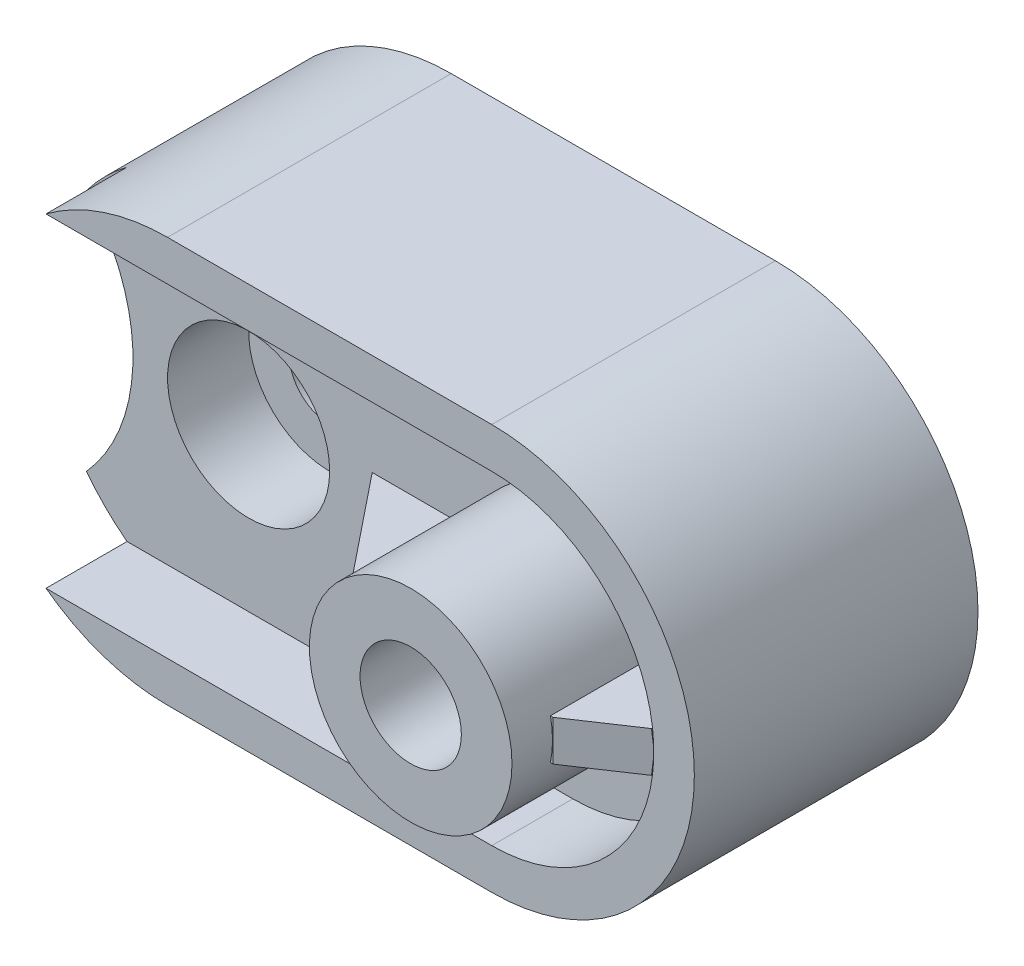
ISO-10303-21;
HEADER;
FILE_DESCRIPTION(('STEP AP214'),'2;1');
FILE_NAME('part.step','',(''),(''),'','','');
FILE_SCHEMA(('AUTOMOTIVE_DESIGN { 1 0 10303 214 1 1 1 1 }'));
ENDSEC;
DATA;
#1=APPLICATION_CONTEXT('core data for automotive mechanical design processes');
#2=APPLICATION_PROTOCOL_DEFINITION('international standard','automotive_design',2000,#1);
#3=PRODUCT_CONTEXT('',#1,'mechanical');
#4=PRODUCT('Part','Part','',(#3));
#5=PRODUCT_RELATED_PRODUCT_CATEGORY('part','',(#4));
#6=PRODUCT_DEFINITION_FORMATION('','',#4);
#7=PRODUCT_DEFINITION_CONTEXT('part definition',#1,'design');
#8=PRODUCT_DEFINITION('design','',#6,#7);
#9=PRODUCT_DEFINITION_SHAPE('','',#8);
#10=(LENGTH_UNIT() NAMED_UNIT(*) SI_UNIT(.MILLI.,.METRE.));
#11=(NAMED_UNIT(*) PLANE_ANGLE_UNIT() SI_UNIT($,.RADIAN.));
#12=(NAMED_UNIT(*) SI_UNIT($,.STERADIAN.) SOLID_ANGLE_UNIT());
#13=UNCERTAINTY_MEASURE_WITH_UNIT(LENGTH_MEASURE(1.E-05),#10,'distance_accuracy_value','');
#14=(GEOMETRIC_REPRESENTATION_CONTEXT(3) GLOBAL_UNCERTAINTY_ASSIGNED_CONTEXT((#13)) GLOBAL_UNIT_ASSIGNED_CONTEXT((#10,
#11,#12)) REPRESENTATION_CONTEXT('',''));
#15=CARTESIAN_POINT('',(0.,0.,0.));
#16=DIRECTION('',(0.,0.,1.));
#17=DIRECTION('',(1.,0.,0.));
#18=AXIS2_PLACEMENT_3D('',#15,#16,#17);
#19=CARTESIAN_POINT('',(0.,0.,50.));
#20=DIRECTION('',(0.,0.,1.));
#21=DIRECTION('',(1.,0.,0.));
#22=AXIS2_PLACEMENT_3D('',#19,#20,#21);
#23=PLANE('',#22);
#24=CARTESIAN_POINT('',(50.,50.,50.));
#25=DIRECTION('',(0.,0.,1.));
#26=DIRECTION('',(1.,0.,0.));
#27=AXIS2_PLACEMENT_3D('',#24,#25,#26);
#28=CIRCLE('',#27,20.);
#29=CARTESIAN_POINT('',(70.,50.,50.));
#30=VERTEX_POINT('',#29);
#31=EDGE_CURVE('E233',#30,#30,#28,.T.);
#32=ORIENTED_EDGE('',*,*,#31,.F.);
#33=EDGE_LOOP('',(#32));
#34=FACE_BOUND('',#33,.T.);
#35=CARTESIAN_POINT('',(130.,50.,50.));
#36=DIRECTION('',(0.,0.,1.));
#37=DIRECTION('',(1.,0.,0.));
#38=AXIS2_PLACEMENT_3D('',#35,#36,#37);
#39=CIRCLE('',#38,40.);
#40=CARTESIAN_POINT('',(169.686269665969,45.,50.));
#41=VERTEX_POINT('',#40);
#42=CARTESIAN_POINT('',(130.,9.99999999999999,50.));
#43=VERTEX_POINT('',#42);
#44=EDGE_CURVE('E253',#41,#43,#39,.F.);
#45=ORIENTED_EDGE('',*,*,#44,.F.);
#46=DIRECTION('',(1.,0.,0.));
#47=VECTOR('',#46,1.);
#48=CARTESIAN_POINT('',(0.,45.,50.));
#49=LINE('',#48,#47);
#50=CARTESIAN_POINT('',(154.494897427832,45.,50.));
#51=VERTEX_POINT('',#50);
#52=EDGE_CURVE('E199',#51,#41,#49,.T.);
#53=ORIENTED_EDGE('',*,*,#52,.F.);
#54=CARTESIAN_POINT('',(130.,50.,50.));
#55=DIRECTION('',(0.,0.,1.));
#56=DIRECTION('',(1.,0.,0.));
#57=AXIS2_PLACEMENT_3D('',#54,#55,#56);
#58=CIRCLE('',#57,25.);
#59=CARTESIAN_POINT('',(105.505102572168,45.,50.));
#60=VERTEX_POINT('',#59);
#61=EDGE_CURVE('E247',#60,#51,#58,.T.);
#62=ORIENTED_EDGE('',*,*,#61,.F.);
#63=DIRECTION('',(-1.,0.,0.));
#64=VECTOR('',#63,1.);
#65=CARTESIAN_POINT('',(0.,45.,50.));
#66=LINE('',#65,#64);
#67=CARTESIAN_POINT('',(80.5051025721682,45.,50.));
#68=VERTEX_POINT('',#67);
#69=EDGE_CURVE('E215',#60,#68,#66,.T.);
#70=ORIENTED_EDGE('',*,*,#69,.T.);
#71=DIRECTION('',(0.,-1.,0.));
#72=VECTOR('',#71,1.);
#73=CARTESIAN_POINT('',(80.5051025721682,0.,50.));
#74=LINE('',#73,#72);
#75=CARTESIAN_POINT('',(80.5051025721682,55.,50.));
#76=VERTEX_POINT('',#75);
#77=EDGE_CURVE('E221',#76,#68,#74,.T.);
#78=ORIENTED_EDGE('',*,*,#77,.F.);
#79=DIRECTION('',(-1.,0.,0.));
#80=VECTOR('',#79,1.);
#81=CARTESIAN_POINT('',(0.,55.,50.));
#82=LINE('',#81,#80);
#83=CARTESIAN_POINT('',(105.505102572168,55.,50.));
#84=VERTEX_POINT('',#83);
#85=EDGE_CURVE('E210',#84,#76,#82,.T.);
#86=ORIENTED_EDGE('',*,*,#85,.F.);
#87=CARTESIAN_POINT('',(154.494897427832,55.,50.));
#88=VERTEX_POINT('',#87);
#89=EDGE_CURVE('E242',#88,#84,#58,.T.);
#90=ORIENTED_EDGE('',*,*,#89,.F.);
#91=DIRECTION('',(1.,0.,0.));
#92=VECTOR('',#91,1.);
#93=CARTESIAN_POINT('',(0.,55.,50.));
#94=LINE('',#93,#92);
#95=CARTESIAN_POINT('',(169.686269665969,55.,50.));
#96=VERTEX_POINT('',#95);
#97=EDGE_CURVE('E195',#88,#96,#94,.T.);
#98=ORIENTED_EDGE('',*,*,#97,.T.);
#99=CARTESIAN_POINT('',(130.,90.,50.));
#100=VERTEX_POINT('',#99);
#101=EDGE_CURVE('E250',#100,#96,#39,.F.);
#102=ORIENTED_EDGE('',*,*,#101,.F.);
#103=DIRECTION('',(-1.,0.,0.));
#104=VECTOR('',#103,1.);
#105=CARTESIAN_POINT('',(0.,90.,50.));
#106=LINE('',#105,#104);
#107=CARTESIAN_POINT('',(20.,90.,50.));
#108=VERTEX_POINT('',#107);
#109=EDGE_CURVE('E252',#100,#108,#106,.T.);
#110=ORIENTED_EDGE('',*,*,#109,.T.);
#111=CARTESIAN_POINT('',(50.,50.,50.));
#112=DIRECTION('',(0.,0.,1.));
#113=DIRECTION('',(1.,0.,0.));
#114=AXIS2_PLACEMENT_3D('',#111,#112,#113);
#115=CIRCLE('',#114,50.);
#116=CARTESIAN_POINT('',(9.99999999999999,80.,50.));
#117=VERTEX_POINT('',#116);
#118=EDGE_CURVE('E256',#108,#117,#115,.T.);
#119=ORIENTED_EDGE('',*,*,#118,.T.);
#120=CARTESIAN_POINT('',(-23.5410196624968,50.,50.));
#121=DIRECTION('',(0.,0.,1.));
#122=DIRECTION('',(1.,0.,0.));
#123=AXIS2_PLACEMENT_3D('',#120,#121,#122);
#124=CIRCLE('',#123,45.);
#125=CARTESIAN_POINT('',(9.99999999999998,20.,50.));
#126=VERTEX_POINT('',#125);
#127=EDGE_CURVE('E258',#117,#126,#124,.F.);
#128=ORIENTED_EDGE('',*,*,#127,.T.);
#129=CARTESIAN_POINT('',(50.,50.,50.));
#130=DIRECTION('',(0.,0.,1.));
#131=DIRECTION('',(1.,0.,0.));
#132=AXIS2_PLACEMENT_3D('',#129,#130,#131);
#133=CIRCLE('',#132,50.);
#134=CARTESIAN_POINT('',(20.,9.99999999999999,50.));
#135=VERTEX_POINT('',#134);
#136=EDGE_CURVE('E260',#126,#135,#133,.T.);
#137=ORIENTED_EDGE('',*,*,#136,.T.);
#138=DIRECTION('',(-1.,0.,0.));
#139=VECTOR('',#138,1.);
#140=CARTESIAN_POINT('',(0.,9.99999999999999,50.));
#141=LINE('',#140,#139);
#142=EDGE_CURVE('E263',#43,#135,#141,.T.);
#143=ORIENTED_EDGE('',*,*,#142,.F.);
#144=EDGE_LOOP('',(#45,#53,#62,#70,#78,#86,#90,#98,#102,#110,#119,#128,#137,#143));
#145=FACE_BOUND('',#144,.T.);
#146=ADVANCED_FACE('F34',(#34,#145),#23,.T.);
#147=CARTESIAN_POINT('',(130.,50.,90.));
#148=DIRECTION('',(0.,0.,-1.));
#149=DIRECTION('',(-1.,0.,0.));
#150=AXIS2_PLACEMENT_3D('',#147,#148,#149);
#151=CYLINDRICAL_SURFACE('',#150,25.);
#152=CARTESIAN_POINT('',(130.,50.,90.));
#153=DIRECTION('',(0.,0.,1.));
#154=DIRECTION('',(1.,0.,0.));
#155=AXIS2_PLACEMENT_3D('',#152,#153,#154);
#156=CIRCLE('',#155,25.);
#157=CARTESIAN_POINT('',(155.,50.,90.));
#158=VERTEX_POINT('',#157);
#159=EDGE_CURVE('E243',#158,#158,#156,.T.);
#160=ORIENTED_EDGE('',*,*,#159,.F.);
#161=EDGE_LOOP('',(#160));
#162=FACE_BOUND('',#161,.T.);
#163=DIRECTION('',(0.,0.,-1.));
#164=VECTOR('',#163,1.);
#165=CARTESIAN_POINT('',(154.494897427832,45.,80.));
#166=LINE('',#165,#164);
#167=CARTESIAN_POINT('',(154.494897427832,45.,80.));
#168=VERTEX_POINT('',#167);
#169=EDGE_CURVE('E208',#168,#51,#166,.T.);
#170=ORIENTED_EDGE('',*,*,#169,.F.);
#171=CARTESIAN_POINT('',(130.,50.,80.));
#172=DIRECTION('',(0.,0.,1.));
#173=DIRECTION('',(1.,0.,0.));
#174=AXIS2_PLACEMENT_3D('',#171,#172,#173);
#175=CIRCLE('',#174,25.);
#176=CARTESIAN_POINT('',(154.494897427832,55.,80.));
#177=VERTEX_POINT('',#176);
#178=EDGE_CURVE('E57',#177,#168,#175,.F.);
#179=ORIENTED_EDGE('',*,*,#178,.F.);
#180=DIRECTION('',(0.,0.,-1.));
#181=VECTOR('',#180,1.);
#182=CARTESIAN_POINT('',(154.494897427832,55.,80.));
#183=LINE('',#182,#181);
#184=EDGE_CURVE('E193',#177,#88,#183,.T.);
#185=ORIENTED_EDGE('',*,*,#184,.T.);
#186=ORIENTED_EDGE('',*,*,#89,.T.);
#187=DIRECTION('',(0.,0.,-1.));
#188=VECTOR('',#187,1.);
#189=CARTESIAN_POINT('',(105.505102572168,55.,80.));
#190=LINE('',#189,#188);
#191=CARTESIAN_POINT('',(105.505102572168,55.,80.));
#192=VERTEX_POINT('',#191);
#193=EDGE_CURVE('E227',#192,#84,#190,.T.);
#194=ORIENTED_EDGE('',*,*,#193,.F.);
#195=CARTESIAN_POINT('',(130.,50.,80.));
#196=DIRECTION('',(0.,0.,1.));
#197=DIRECTION('',(1.,0.,0.));
#198=AXIS2_PLACEMENT_3D('',#195,#196,#197);
#199=CIRCLE('',#198,25.);
#200=CARTESIAN_POINT('',(105.505102572168,45.,80.));
#201=VERTEX_POINT('',#200);
#202=EDGE_CURVE('E335',#192,#201,#199,.T.);
#203=ORIENTED_EDGE('',*,*,#202,.T.);
#204=DIRECTION('',(0.,0.,-1.));
#205=VECTOR('',#204,1.);
#206=CARTESIAN_POINT('',(105.505102572168,45.,80.));
#207=LINE('',#206,#205);
#208=EDGE_CURVE('E218',#201,#60,#207,.T.);
#209=ORIENTED_EDGE('',*,*,#208,.T.);
#210=ORIENTED_EDGE('',*,*,#61,.T.);
#211=EDGE_LOOP('',(#170,#179,#185,#186,#194,#203,#209,#210));
#212=FACE_BOUND('',#211,.T.);
#213=ADVANCED_FACE('F400',(#162,#212),#151,.T.);
#214=CARTESIAN_POINT('',(130.,50.,50.));
#215=DIRECTION('',(0.,0.,1.));
#216=DIRECTION('',(1.,0.,0.));
#217=AXIS2_PLACEMENT_3D('',#214,#215,#216);
#218=CYLINDRICAL_SURFACE('',#217,40.);
#219=CARTESIAN_POINT('',(130.,50.,70.));
#220=DIRECTION('',(0.,0.,1.));
#221=DIRECTION('',(1.,0.,0.));
#222=AXIS2_PLACEMENT_3D('',#219,#220,#221);
#223=CIRCLE('',#222,40.);
#224=CARTESIAN_POINT('',(169.686269665969,45.,70.));
#225=VERTEX_POINT('',#224);
#226=CARTESIAN_POINT('',(130.,9.99999999999999,70.));
#227=VERTEX_POINT('',#226);
#228=EDGE_CURVE('E246',#225,#227,#223,.F.);
#229=ORIENTED_EDGE('',*,*,#228,.F.);
#230=DIRECTION('',(0.,0.,1.));
#231=VECTOR('',#230,1.);
#232=CARTESIAN_POINT('',(169.686269665969,45.,50.));
#233=LINE('',#232,#231);
#234=EDGE_CURVE('E11',#225,#41,#233,.F.);
#235=ORIENTED_EDGE('',*,*,#234,.T.);
#236=ORIENTED_EDGE('',*,*,#44,.T.);
#237=DIRECTION('',(0.,0.,1.));
#238=VECTOR('',#237,1.);
#239=CARTESIAN_POINT('',(130.,9.99999999999999,50.));
#240=LINE('',#239,#238);
#241=EDGE_CURVE('E278',#43,#227,#240,.T.);
#242=ORIENTED_EDGE('',*,*,#241,.T.);
#243=EDGE_LOOP('',(#229,#235,#236,#242));
#244=FACE_BOUND('',#243,.T.);
#245=ADVANCED_FACE('F367',(#244),#218,.F.);
#246=CARTESIAN_POINT('',(50.,50.,-36.));
#247=DIRECTION('',(0.,0.,1.));
#248=DIRECTION('',(1.,0.,0.));
#249=AXIS2_PLACEMENT_3D('',#246,#247,#248);
#250=CYLINDRICAL_SURFACE('',#249,10.);
#251=CARTESIAN_POINT('',(50.,50.,0.));
#252=DIRECTION('',(0.,0.,-1.));
#253=DIRECTION('',(-1.,0.,0.));
#254=AXIS2_PLACEMENT_3D('',#251,#252,#253);
#255=CIRCLE('',#254,10.);
#256=CARTESIAN_POINT('',(40.,50.,0.));
#257=VERTEX_POINT('',#256);
#258=EDGE_CURVE('E281',#257,#257,#255,.T.);
#259=ORIENTED_EDGE('',*,*,#258,.T.);
#260=EDGE_LOOP('',(#259));
#261=FACE_BOUND('',#260,.T.);
#262=CARTESIAN_POINT('',(50.,50.,30.));
#263=DIRECTION('',(0.,0.,1.));
#264=DIRECTION('',(1.,0.,0.));
#265=AXIS2_PLACEMENT_3D('',#262,#263,#264);
#266=CIRCLE('',#265,10.);
#267=CARTESIAN_POINT('',(60.,50.,30.));
#268=VERTEX_POINT('',#267);
#269=EDGE_CURVE('E230',#268,#268,#266,.T.);
#270=ORIENTED_EDGE('',*,*,#269,.T.);
#271=EDGE_LOOP('',(#270));
#272=FACE_BOUND('',#271,.T.);
#273=ADVANCED_FACE('F454',(#261,#272),#250,.F.);
#274=CARTESIAN_POINT('',(0.,0.,70.));
#275=DIRECTION('',(0.,0.,-1.));
#276=DIRECTION('',(-1.,0.,0.));
#277=AXIS2_PLACEMENT_3D('',#274,#275,#276);
#278=PLANE('',#277);
#279=DIRECTION('',(-1.,0.,0.));
#280=VECTOR('',#279,1.);
#281=CARTESIAN_POINT('',(0.,9.99999999999999,70.));
#282=LINE('',#281,#280);
#283=CARTESIAN_POINT('',(20.,9.99999999999999,70.));
#284=VERTEX_POINT('',#283);
#285=EDGE_CURVE('E275',#227,#284,#282,.T.);
#286=ORIENTED_EDGE('',*,*,#285,.T.);
#287=CARTESIAN_POINT('',(50.,50.,70.));
#288=DIRECTION('',(0.,0.,1.));
#289=DIRECTION('',(1.,0.,0.));
#290=AXIS2_PLACEMENT_3D('',#287,#288,#289);
#291=CIRCLE('',#290,50.);
#292=CARTESIAN_POINT('',(50.,0.,70.));
#293=VERTEX_POINT('',#292);
#294=EDGE_CURVE('E319',#284,#293,#291,.T.);
#295=ORIENTED_EDGE('',*,*,#294,.T.);
#296=DIRECTION('',(1.,0.,0.));
#297=VECTOR('',#296,1.);
#298=CARTESIAN_POINT('',(0.,0.,70.));
#299=LINE('',#298,#297);
#300=CARTESIAN_POINT('',(130.,0.,70.));
#301=VERTEX_POINT('',#300);
#302=EDGE_CURVE('E329',#293,#301,#299,.T.);
#303=ORIENTED_EDGE('',*,*,#302,.T.);
#304=CARTESIAN_POINT('',(130.,50.,70.));
#305=DIRECTION('',(0.,0.,1.));
#306=DIRECTION('',(1.,0.,0.));
#307=AXIS2_PLACEMENT_3D('',#304,#305,#306);
#308=CIRCLE('',#307,50.);
#309=CARTESIAN_POINT('',(130.,100.,70.));
#310=VERTEX_POINT('',#309);
#311=EDGE_CURVE('E308',#310,#301,#308,.F.);
#312=ORIENTED_EDGE('',*,*,#311,.F.);
#313=DIRECTION('',(-1.,0.,0.));
#314=VECTOR('',#313,1.);
#315=CARTESIAN_POINT('',(0.,100.,70.));
#316=LINE('',#315,#314);
#317=CARTESIAN_POINT('',(50.,100.,70.));
#318=VERTEX_POINT('',#317);
#319=EDGE_CURVE('E332',#310,#318,#316,.T.);
#320=ORIENTED_EDGE('',*,*,#319,.T.);
#321=CARTESIAN_POINT('',(20.,90.,70.));
#322=VERTEX_POINT('',#321);
#323=EDGE_CURVE('E323',#318,#322,#291,.T.);
#324=ORIENTED_EDGE('',*,*,#323,.T.);
#325=DIRECTION('',(-1.,0.,0.));
#326=VECTOR('',#325,1.);
#327=CARTESIAN_POINT('',(0.,90.,70.));
#328=LINE('',#327,#326);
#329=CARTESIAN_POINT('',(130.,90.,70.));
#330=VERTEX_POINT('',#329);
#331=EDGE_CURVE('E272',#330,#322,#328,.T.);
#332=ORIENTED_EDGE('',*,*,#331,.F.);
#333=CARTESIAN_POINT('',(169.686269665969,55.,70.));
#334=VERTEX_POINT('',#333);
#335=EDGE_CURVE('E269',#330,#334,#223,.F.);
#336=ORIENTED_EDGE('',*,*,#335,.T.);
#337=EDGE_CURVE('E273',#334,#225,#223,.F.);
#338=ORIENTED_EDGE('',*,*,#337,.T.);
#339=ORIENTED_EDGE('',*,*,#228,.T.);
#340=EDGE_LOOP('',(#286,#295,#303,#312,#320,#324,#332,#336,#338,#339));
#341=FACE_BOUND('',#340,.T.);
#342=ADVANCED_FACE('F356',(#341),#278,.F.);
#343=CARTESIAN_POINT('',(50.,50.,0.));
#344=DIRECTION('',(0.,0.,1.));
#345=DIRECTION('',(1.,0.,0.));
#346=AXIS2_PLACEMENT_3D('',#343,#344,#345);
#347=CYLINDRICAL_SURFACE('',#346,50.);
#348=ORIENTED_EDGE('',*,*,#294,.F.);
#349=DIRECTION('',(0.,0.,1.));
#350=VECTOR('',#349,1.);
#351=CARTESIAN_POINT('',(20.,9.99999999999999,50.));
#352=LINE('',#351,#350);
#353=EDGE_CURVE('E282',#135,#284,#352,.T.);
#354=ORIENTED_EDGE('',*,*,#353,.F.);
#355=ORIENTED_EDGE('',*,*,#136,.F.);
#356=DIRECTION('',(0.,0.,1.));
#357=VECTOR('',#356,1.);
#358=CARTESIAN_POINT('',(9.99999999999998,20.,20.));
#359=LINE('',#358,#357);
#360=CARTESIAN_POINT('',(9.99999999999998,20.,20.));
#361=VERTEX_POINT('',#360);
#362=EDGE_CURVE('E297',#361,#126,#359,.T.);
#363=ORIENTED_EDGE('',*,*,#362,.F.);
#364=CARTESIAN_POINT('',(50.,50.,20.));
#365=DIRECTION('',(0.,0.,1.));
#366=DIRECTION('',(1.,0.,0.));
#367=AXIS2_PLACEMENT_3D('',#364,#365,#366);
#368=CIRCLE('',#367,50.);
#369=CARTESIAN_POINT('',(9.99999999999999,80.,20.));
#370=VERTEX_POINT('',#369);
#371=EDGE_CURVE('E290',#370,#361,#368,.T.);
#372=ORIENTED_EDGE('',*,*,#371,.F.);
#373=DIRECTION('',(0.,0.,1.));
#374=VECTOR('',#373,1.);
#375=CARTESIAN_POINT('',(9.99999999999999,80.,20.));
#376=LINE('',#375,#374);
#377=EDGE_CURVE('E296',#370,#117,#376,.T.);
#378=ORIENTED_EDGE('',*,*,#377,.T.);
#379=ORIENTED_EDGE('',*,*,#118,.F.);
#380=DIRECTION('',(0.,0.,1.));
#381=VECTOR('',#380,1.);
#382=CARTESIAN_POINT('',(20.,90.,50.));
#383=LINE('',#382,#381);
#384=EDGE_CURVE('E284',#108,#322,#383,.T.);
#385=ORIENTED_EDGE('',*,*,#384,.T.);
#386=ORIENTED_EDGE('',*,*,#323,.F.);
#387=DIRECTION('',(0.,0.,1.));
#388=VECTOR('',#387,1.);
#389=CARTESIAN_POINT('',(50.,100.,0.));
#390=LINE('',#389,#388);
#391=CARTESIAN_POINT('',(50.,100.,0.));
#392=VERTEX_POINT('',#391);
#393=EDGE_CURVE('E322',#392,#318,#390,.T.);
#394=ORIENTED_EDGE('',*,*,#393,.F.);
#395=CARTESIAN_POINT('',(50.,50.,0.));
#396=DIRECTION('',(0.,0.,1.));
#397=DIRECTION('',(1.,0.,0.));
#398=AXIS2_PLACEMENT_3D('',#395,#396,#397);
#399=CIRCLE('',#398,50.);
#400=CARTESIAN_POINT('',(50.,0.,0.));
#401=VERTEX_POINT('',#400);
#402=EDGE_CURVE('E320',#392,#401,#399,.T.);
#403=ORIENTED_EDGE('',*,*,#402,.T.);
#404=DIRECTION('',(0.,0.,1.));
#405=VECTOR('',#404,1.);
#406=CARTESIAN_POINT('',(50.,0.,0.));
#407=LINE('',#406,#405);
#408=EDGE_CURVE('E316',#401,#293,#407,.T.);
#409=ORIENTED_EDGE('',*,*,#408,.T.);
#410=EDGE_LOOP('',(#348,#354,#355,#363,#372,#378,#379,#385,#386,#394,#403,#409));
#411=FACE_BOUND('',#410,.T.);
#412=ADVANCED_FACE('F375',(#411),#347,.T.);
#413=CARTESIAN_POINT('',(-23.5410196624968,50.,20.));
#414=DIRECTION('',(0.,0.,1.));
#415=DIRECTION('',(1.,0.,0.));
#416=AXIS2_PLACEMENT_3D('',#413,#414,#415);
#417=CYLINDRICAL_SURFACE('',#416,45.);
#418=ORIENTED_EDGE('',*,*,#362,.T.);
#419=ORIENTED_EDGE('',*,*,#127,.F.);
#420=ORIENTED_EDGE('',*,*,#377,.F.);
#421=CARTESIAN_POINT('',(-23.5410196624968,50.,20.));
#422=DIRECTION('',(0.,0.,1.));
#423=DIRECTION('',(1.,0.,0.));
#424=AXIS2_PLACEMENT_3D('',#421,#422,#423);
#425=CIRCLE('',#424,45.);
#426=EDGE_CURVE('E288',#370,#361,#425,.F.);
#427=ORIENTED_EDGE('',*,*,#426,.T.);
#428=EDGE_LOOP('',(#418,#419,#420,#427));
#429=FACE_BOUND('',#428,.T.);
#430=ADVANCED_FACE('F461',(#429),#417,.F.);
#431=CARTESIAN_POINT('',(9.99999999999997,50.,0.));
#432=DIRECTION('',(0.,0.,1.));
#433=DIRECTION('',(1.,0.,0.));
#434=AXIS2_PLACEMENT_3D('',#431,#432,#433);
#435=CYLINDRICAL_SURFACE('',#434,5.);
#436=CARTESIAN_POINT('',(9.99999999999997,50.,0.));
#437=DIRECTION('',(0.,0.,1.));
#438=DIRECTION('',(1.,0.,0.));
#439=AXIS2_PLACEMENT_3D('',#436,#437,#438);
#440=CIRCLE('',#439,5.);
#441=CARTESIAN_POINT('',(15.,50.,0.));
#442=VERTEX_POINT('',#441);
#443=EDGE_CURVE('E300',#442,#442,#440,.T.);
#444=ORIENTED_EDGE('',*,*,#443,.F.);
#445=EDGE_LOOP('',(#444));
#446=FACE_BOUND('',#445,.T.);
#447=CARTESIAN_POINT('',(9.99999999999997,50.,20.));
#448=DIRECTION('',(0.,0.,1.));
#449=DIRECTION('',(1.,0.,0.));
#450=AXIS2_PLACEMENT_3D('',#447,#448,#449);
#451=CIRCLE('',#450,5.);
#452=CARTESIAN_POINT('',(15.,50.,20.));
#453=VERTEX_POINT('',#452);
#454=EDGE_CURVE('E293',#453,#453,#451,.F.);
#455=ORIENTED_EDGE('',*,*,#454,.F.);
#456=EDGE_LOOP('',(#455));
#457=FACE_BOUND('',#456,.T.);
#458=ADVANCED_FACE('F464',(#446,#457),#435,.F.);
#459=CARTESIAN_POINT('',(0.,0.,70.));
#460=DIRECTION('',(0.,1.,0.));
#461=DIRECTION('',(0.,0.,1.));
#462=AXIS2_PLACEMENT_3D('',#459,#460,#461);
#463=PLANE('',#462);
#464=DIRECTION('',(0.,0.,1.));
#465=VECTOR('',#464,1.);
#466=CARTESIAN_POINT('',(130.,0.,0.));
#467=LINE('',#466,#465);
#468=CARTESIAN_POINT('',(130.,0.,0.));
#469=VERTEX_POINT('',#468);
#470=EDGE_CURVE('E312',#469,#301,#467,.T.);
#471=ORIENTED_EDGE('',*,*,#470,.T.);
#472=ORIENTED_EDGE('',*,*,#302,.F.);
#473=ORIENTED_EDGE('',*,*,#408,.F.);
#474=DIRECTION('',(1.,0.,0.));
#475=VECTOR('',#474,1.);
#476=CARTESIAN_POINT('',(0.,0.,0.));
#477=LINE('',#476,#475);
#478=EDGE_CURVE('E328',#401,#469,#477,.T.);
#479=ORIENTED_EDGE('',*,*,#478,.T.);
#480=EDGE_LOOP('',(#471,#472,#473,#479));
#481=FACE_BOUND('',#480,.T.);
#482=ADVANCED_FACE('F36',(#481),#463,.F.);
#483=CARTESIAN_POINT('',(0.,0.,0.));
#484=DIRECTION('',(0.,0.,-1.));
#485=DIRECTION('',(-1.,0.,0.));
#486=AXIS2_PLACEMENT_3D('',#483,#484,#485);
#487=PLANE('',#486);
#488=ORIENTED_EDGE('',*,*,#258,.F.);
#489=EDGE_LOOP('',(#488));
#490=FACE_BOUND('',#489,.T.);
#491=ORIENTED_EDGE('',*,*,#443,.T.);
#492=EDGE_LOOP('',(#491));
#493=FACE_BOUND('',#492,.T.);
#494=DIRECTION('',(-1.,0.,0.));
#495=VECTOR('',#494,1.);
#496=CARTESIAN_POINT('',(0.,100.,0.));
#497=LINE('',#496,#495);
#498=CARTESIAN_POINT('',(130.,100.,0.));
#499=VERTEX_POINT('',#498);
#500=EDGE_CURVE('E333',#499,#392,#497,.T.);
#501=ORIENTED_EDGE('',*,*,#500,.F.);
#502=CARTESIAN_POINT('',(130.,50.,0.));
#503=DIRECTION('',(0.,0.,1.));
#504=DIRECTION('',(1.,0.,0.));
#505=AXIS2_PLACEMENT_3D('',#502,#503,#504);
#506=CIRCLE('',#505,50.);
#507=EDGE_CURVE('E309',#499,#469,#506,.F.);
#508=ORIENTED_EDGE('',*,*,#507,.T.);
#509=ORIENTED_EDGE('',*,*,#478,.F.);
#510=ORIENTED_EDGE('',*,*,#402,.F.);
#511=EDGE_LOOP('',(#501,#508,#509,#510));
#512=FACE_BOUND('',#511,.T.);
#513=ADVANCED_FACE('F385',(#490,#493,#512),#487,.T.);
#514=CARTESIAN_POINT('',(0.,100.,70.));
#515=DIRECTION('',(0.,-1.,0.));
#516=DIRECTION('',(0.,0.,-1.));
#517=AXIS2_PLACEMENT_3D('',#514,#515,#516);
#518=PLANE('',#517);
#519=ORIENTED_EDGE('',*,*,#319,.F.);
#520=DIRECTION('',(0.,0.,1.));
#521=VECTOR('',#520,1.);
#522=CARTESIAN_POINT('',(130.,100.,0.));
#523=LINE('',#522,#521);
#524=EDGE_CURVE('E305',#499,#310,#523,.T.);
#525=ORIENTED_EDGE('',*,*,#524,.F.);
#526=ORIENTED_EDGE('',*,*,#500,.T.);
#527=ORIENTED_EDGE('',*,*,#393,.T.);
#528=EDGE_LOOP('',(#519,#525,#526,#527));
#529=FACE_BOUND('',#528,.T.);
#530=ADVANCED_FACE('F390',(#529),#518,.F.);
#531=CARTESIAN_POINT('',(130.,50.,0.));
#532=DIRECTION('',(0.,0.,1.));
#533=DIRECTION('',(1.,0.,0.));
#534=AXIS2_PLACEMENT_3D('',#531,#532,#533);
#535=CYLINDRICAL_SURFACE('',#534,50.);
#536=ORIENTED_EDGE('',*,*,#311,.T.);
#537=ORIENTED_EDGE('',*,*,#470,.F.);
#538=ORIENTED_EDGE('',*,*,#507,.F.);
#539=ORIENTED_EDGE('',*,*,#524,.T.);
#540=EDGE_LOOP('',(#536,#537,#538,#539));
#541=FACE_BOUND('',#540,.T.);
#542=ADVANCED_FACE('F381',(#541),#535,.T.);
#543=CARTESIAN_POINT('',(0.,0.,20.));
#544=DIRECTION('',(0.,0.,1.));
#545=DIRECTION('',(1.,0.,0.));
#546=AXIS2_PLACEMENT_3D('',#543,#544,#545);
#547=PLANE('',#546);
#548=ORIENTED_EDGE('',*,*,#426,.F.);
#549=ORIENTED_EDGE('',*,*,#371,.T.);
#550=EDGE_LOOP('',(#548,#549));
#551=FACE_BOUND('',#550,.T.);
#552=ORIENTED_EDGE('',*,*,#454,.T.);
#553=EDGE_LOOP('',(#552));
#554=FACE_BOUND('',#553,.T.);
#555=ADVANCED_FACE('F447',(#551,#554),#547,.T.);
#556=DIRECTION('',(0.,0.,1.));
#557=VECTOR('',#556,1.);
#558=CARTESIAN_POINT('',(169.686269665969,55.,50.));
#559=LINE('',#558,#557);
#560=EDGE_CURVE('E42',#334,#96,#559,.F.);
#561=ORIENTED_EDGE('',*,*,#560,.F.);
#562=ORIENTED_EDGE('',*,*,#335,.F.);
#563=DIRECTION('',(0.,0.,1.));
#564=VECTOR('',#563,1.);
#565=CARTESIAN_POINT('',(130.,90.,50.));
#566=LINE('',#565,#564);
#567=EDGE_CURVE('E268',#100,#330,#566,.T.);
#568=ORIENTED_EDGE('',*,*,#567,.F.);
#569=ORIENTED_EDGE('',*,*,#101,.T.);
#570=EDGE_LOOP('',(#561,#562,#568,#569));
#571=FACE_BOUND('',#570,.T.);
#572=ADVANCED_FACE('F350',(#571),#218,.F.);
#573=CARTESIAN_POINT('',(0.,9.99999999999999,50.));
#574=DIRECTION('',(0.,1.,0.));
#575=DIRECTION('',(0.,0.,1.));
#576=AXIS2_PLACEMENT_3D('',#573,#574,#575);
#577=PLANE('',#576);
#578=ORIENTED_EDGE('',*,*,#285,.F.);
#579=ORIENTED_EDGE('',*,*,#241,.F.);
#580=ORIENTED_EDGE('',*,*,#142,.T.);
#581=ORIENTED_EDGE('',*,*,#353,.T.);
#582=EDGE_LOOP('',(#578,#579,#580,#581));
#583=FACE_BOUND('',#582,.T.);
#584=ADVANCED_FACE('F365',(#583),#577,.T.);
#585=CARTESIAN_POINT('',(0.,90.,50.));
#586=DIRECTION('',(0.,1.,0.));
#587=DIRECTION('',(0.,0.,1.));
#588=AXIS2_PLACEMENT_3D('',#585,#586,#587);
#589=PLANE('',#588);
#590=ORIENTED_EDGE('',*,*,#331,.T.);
#591=ORIENTED_EDGE('',*,*,#384,.F.);
#592=ORIENTED_EDGE('',*,*,#109,.F.);
#593=ORIENTED_EDGE('',*,*,#567,.T.);
#594=EDGE_LOOP('',(#590,#591,#592,#593));
#595=FACE_BOUND('',#594,.T.);
#596=ADVANCED_FACE('F395',(#595),#589,.F.);
#597=CARTESIAN_POINT('',(130.,50.,90.));
#598=DIRECTION('',(0.,0.,1.));
#599=DIRECTION('',(1.,0.,0.));
#600=AXIS2_PLACEMENT_3D('',#597,#598,#599);
#601=PLANE('',#600);
#602=ORIENTED_EDGE('',*,*,#159,.T.);
#603=EDGE_LOOP('',(#602));
#604=FACE_BOUND('',#603,.T.);
#605=CARTESIAN_POINT('',(130.,50.,90.));
#606=DIRECTION('',(0.,0.,1.));
#607=DIRECTION('',(1.,0.,0.));
#608=AXIS2_PLACEMENT_3D('',#605,#606,#607);
#609=CIRCLE('',#608,12.5);
#610=CARTESIAN_POINT('',(142.5,50.,90.));
#611=VERTEX_POINT('',#610);
#612=EDGE_CURVE('E237',#611,#611,#609,.T.);
#613=ORIENTED_EDGE('',*,*,#612,.F.);
#614=EDGE_LOOP('',(#613));
#615=FACE_BOUND('',#614,.T.);
#616=ADVANCED_FACE('F444',(#604,#615),#601,.T.);
#617=CARTESIAN_POINT('',(130.,50.,90.));
#618=DIRECTION('',(0.,0.,-1.));
#619=DIRECTION('',(-1.,0.,0.));
#620=AXIS2_PLACEMENT_3D('',#617,#618,#619);
#621=CYLINDRICAL_SURFACE('',#620,12.5);
#622=ORIENTED_EDGE('',*,*,#612,.T.);
#623=EDGE_LOOP('',(#622));
#624=FACE_BOUND('',#623,.T.);
#625=CARTESIAN_POINT('',(130.,50.,50.));
#626=DIRECTION('',(0.,0.,1.));
#627=DIRECTION('',(1.,0.,0.));
#628=AXIS2_PLACEMENT_3D('',#625,#626,#627);
#629=CIRCLE('',#628,12.5);
#630=CARTESIAN_POINT('',(142.5,50.,50.));
#631=VERTEX_POINT('',#630);
#632=EDGE_CURVE('E265',#631,#631,#629,.F.);
#633=ORIENTED_EDGE('',*,*,#632,.T.);
#634=EDGE_LOOP('',(#633));
#635=FACE_BOUND('',#634,.T.);
#636=ADVANCED_FACE('F452',(#624,#635),#621,.F.);
#637=CARTESIAN_POINT('',(130.,50.,50.));
#638=DIRECTION('',(0.,0.,1.));
#639=DIRECTION('',(1.,0.,0.));
#640=AXIS2_PLACEMENT_3D('',#637,#638,#639);
#641=CONICAL_SURFACE('',#640,12.5,1.02974425867665);
#642=CARTESIAN_POINT('',(130.,50.,42.4892422621555));
#643=VERTEX_POINT('',#642);
#644=VERTEX_LOOP('',#643);
#645=FACE_BOUND('',#644,.T.);
#646=ORIENTED_EDGE('',*,*,#632,.F.);
#647=EDGE_LOOP('',(#646));
#648=FACE_BOUND('',#647,.T.);
#649=ADVANCED_FACE('F448',(#645,#648),#641,.F.);
#650=CARTESIAN_POINT('',(50.,50.,30.));
#651=DIRECTION('',(0.,0.,1.));
#652=DIRECTION('',(1.,0.,0.));
#653=AXIS2_PLACEMENT_3D('',#650,#651,#652);
#654=CYLINDRICAL_SURFACE('',#653,20.);
#655=CARTESIAN_POINT('',(50.,50.,30.));
#656=DIRECTION('',(0.,0.,1.));
#657=DIRECTION('',(1.,0.,0.));
#658=AXIS2_PLACEMENT_3D('',#655,#656,#657);
#659=CIRCLE('',#658,20.);
#660=CARTESIAN_POINT('',(70.,50.,30.));
#661=VERTEX_POINT('',#660);
#662=EDGE_CURVE('E234',#661,#661,#659,.T.);
#663=ORIENTED_EDGE('',*,*,#662,.F.);
#664=EDGE_LOOP('',(#663));
#665=FACE_BOUND('',#664,.T.);
#666=ORIENTED_EDGE('',*,*,#31,.T.);
#667=EDGE_LOOP('',(#666));
#668=FACE_BOUND('',#667,.T.);
#669=ADVANCED_FACE('F451',(#665,#668),#654,.F.);
#670=CARTESIAN_POINT('',(50.,50.,30.));
#671=DIRECTION('',(0.,0.,1.));
#672=DIRECTION('',(1.,0.,0.));
#673=AXIS2_PLACEMENT_3D('',#670,#671,#672);
#674=PLANE('',#673);
#675=ORIENTED_EDGE('',*,*,#269,.F.);
#676=EDGE_LOOP('',(#675));
#677=FACE_BOUND('',#676,.T.);
#678=ORIENTED_EDGE('',*,*,#662,.T.);
#679=EDGE_LOOP('',(#678));
#680=FACE_BOUND('',#679,.T.);
#681=ADVANCED_FACE('F532',(#677,#680),#674,.T.);
#682=CARTESIAN_POINT('',(0.,0.,80.));
#683=DIRECTION('',(0.,0.,1.));
#684=DIRECTION('',(1.,0.,0.));
#685=AXIS2_PLACEMENT_3D('',#682,#683,#684);
#686=PLANE('',#685);
#687=DIRECTION('',(0.,1.,0.));
#688=VECTOR('',#687,1.);
#689=CARTESIAN_POINT('',(104.57894091063,45.,80.));
#690=LINE('',#689,#688);
#691=CARTESIAN_POINT('',(104.57894091063,45.,80.));
#692=VERTEX_POINT('',#691);
#693=CARTESIAN_POINT('',(104.57894091063,55.,80.));
#694=VERTEX_POINT('',#693);
#695=EDGE_CURVE('E409',#692,#694,#690,.T.);
#696=ORIENTED_EDGE('',*,*,#695,.F.);
#697=DIRECTION('',(-1.,0.,0.));
#698=VECTOR('',#697,1.);
#699=CARTESIAN_POINT('',(0.,45.,80.));
#700=LINE('',#699,#698);
#701=EDGE_CURVE('E214',#201,#692,#700,.T.);
#702=ORIENTED_EDGE('',*,*,#701,.F.);
#703=ORIENTED_EDGE('',*,*,#202,.F.);
#704=DIRECTION('',(-1.,0.,0.));
#705=VECTOR('',#704,1.);
#706=CARTESIAN_POINT('',(0.,55.,80.));
#707=LINE('',#706,#705);
#708=EDGE_CURVE('E211',#192,#694,#707,.T.);
#709=ORIENTED_EDGE('',*,*,#708,.T.);
#710=EDGE_LOOP('',(#696,#702,#703,#709));
#711=FACE_BOUND('',#710,.T.);
#712=ADVANCED_FACE('F408',(#711),#686,.T.);
#713=CARTESIAN_POINT('',(0.,55.,80.));
#714=DIRECTION('',(0.,-1.,0.));
#715=DIRECTION('',(1.,0.,0.));
#716=AXIS2_PLACEMENT_3D('',#713,#714,#715);
#717=PLANE('',#716);
#718=ORIENTED_EDGE('',*,*,#85,.T.);
#719=DIRECTION('',(-0.625864850773297,0.,-0.779931528127001));
#720=VECTOR('',#719,1.);
#721=CARTESIAN_POINT('',(104.57894091063,55.,80.));
#722=LINE('',#721,#720);
#723=EDGE_CURVE('E405',#694,#76,#722,.T.);
#724=ORIENTED_EDGE('',*,*,#723,.F.);
#725=ORIENTED_EDGE('',*,*,#708,.F.);
#726=ORIENTED_EDGE('',*,*,#193,.T.);
#727=EDGE_LOOP('',(#718,#724,#725,#726));
#728=FACE_BOUND('',#727,.T.);
#729=ADVANCED_FACE('F403',(#728),#717,.F.);
#730=CARTESIAN_POINT('',(0.,45.,80.));
#731=DIRECTION('',(0.,-1.,0.));
#732=DIRECTION('',(1.,0.,0.));
#733=AXIS2_PLACEMENT_3D('',#730,#731,#732);
#734=PLANE('',#733);
#735=DIRECTION('',(-0.625864850773297,0.,-0.779931528127001));
#736=VECTOR('',#735,1.);
#737=CARTESIAN_POINT('',(104.57894091063,45.,80.));
#738=LINE('',#737,#736);
#739=EDGE_CURVE('E415',#692,#68,#738,.T.);
#740=ORIENTED_EDGE('',*,*,#739,.T.);
#741=ORIENTED_EDGE('',*,*,#69,.F.);
#742=ORIENTED_EDGE('',*,*,#208,.F.);
#743=ORIENTED_EDGE('',*,*,#701,.T.);
#744=EDGE_LOOP('',(#740,#741,#742,#743));
#745=FACE_BOUND('',#744,.T.);
#746=ADVANCED_FACE('F414',(#745),#734,.T.);
#747=CARTESIAN_POINT('',(130.,50.,80.));
#748=DIRECTION('',(0.,0.,-1.));
#749=DIRECTION('',(-1.,0.,0.));
#750=AXIS2_PLACEMENT_3D('',#747,#748,#749);
#751=CYLINDRICAL_SURFACE('',#750,40.);
#752=DIRECTION('',(0.,0.,-1.));
#753=VECTOR('',#752,1.);
#754=CARTESIAN_POINT('',(169.686269665969,55.,80.));
#755=LINE('',#754,#753);
#756=CARTESIAN_POINT('',(169.686269665969,55.,70.2759725439482));
#757=VERTEX_POINT('',#756);
#758=EDGE_CURVE('E205',#757,#334,#755,.T.);
#759=ORIENTED_EDGE('',*,*,#758,.F.);
#760=CARTESIAN_POINT('',(130.,50.,96.8368636461383));
#761=DIRECTION('',(-0.556197994044663,0.,-0.831049812839575));
#762=DIRECTION('',(0.831049812839575,0.,-0.556197994044664));
#763=AXIS2_PLACEMENT_3D('',#760,#761,#762);
#764=ELLIPSE('',#763,48.1318921946759,40.);
#765=CARTESIAN_POINT('',(169.686269665969,45.,70.2759725439482));
#766=VERTEX_POINT('',#765);
#767=EDGE_CURVE('E179',#757,#766,#764,.T.);
#768=ORIENTED_EDGE('',*,*,#767,.T.);
#769=DIRECTION('',(0.,0.,-1.));
#770=VECTOR('',#769,1.);
#771=CARTESIAN_POINT('',(169.686269665969,45.,80.));
#772=LINE('',#771,#770);
#773=EDGE_CURVE('E188',#766,#225,#772,.T.);
#774=ORIENTED_EDGE('',*,*,#773,.T.);
#775=ORIENTED_EDGE('',*,*,#337,.F.);
#776=EDGE_LOOP('',(#759,#768,#774,#775));
#777=FACE_BOUND('',#776,.T.);
#778=ADVANCED_FACE('F358',(#777),#751,.T.);
#779=CARTESIAN_POINT('',(0.,45.,80.));
#780=DIRECTION('',(0.,1.,0.));
#781=DIRECTION('',(0.,0.,1.));
#782=AXIS2_PLACEMENT_3D('',#779,#780,#781);
#783=PLANE('',#782);
#784=ORIENTED_EDGE('',*,*,#773,.F.);
#785=DIRECTION('',(-0.831049812839575,0.,0.556197994044663));
#786=VECTOR('',#785,1.);
#787=CARTESIAN_POINT('',(155.156999003497,45.,80.));
#788=LINE('',#787,#786);
#789=CARTESIAN_POINT('',(155.156999003497,45.,80.));
#790=VERTEX_POINT('',#789);
#791=EDGE_CURVE('E173',#766,#790,#788,.T.);
#792=ORIENTED_EDGE('',*,*,#791,.T.);
#793=DIRECTION('',(1.,0.,0.));
#794=VECTOR('',#793,1.);
#795=CARTESIAN_POINT('',(0.,45.,80.));
#796=LINE('',#795,#794);
#797=EDGE_CURVE('E186',#168,#790,#796,.T.);
#798=ORIENTED_EDGE('',*,*,#797,.F.);
#799=ORIENTED_EDGE('',*,*,#169,.T.);
#800=ORIENTED_EDGE('',*,*,#52,.T.);
#801=ORIENTED_EDGE('',*,*,#234,.F.);
#802=EDGE_LOOP('',(#784,#792,#798,#799,#800,#801));
#803=FACE_BOUND('',#802,.T.);
#804=ADVANCED_FACE('F184',(#803),#783,.F.);
#805=CARTESIAN_POINT('',(0.,55.,80.));
#806=DIRECTION('',(0.,1.,0.));
#807=DIRECTION('',(0.,0.,1.));
#808=AXIS2_PLACEMENT_3D('',#805,#806,#807);
#809=PLANE('',#808);
#810=DIRECTION('',(-0.831049812839575,0.,0.556197994044663));
#811=VECTOR('',#810,1.);
#812=CARTESIAN_POINT('',(155.156999003497,55.,80.));
#813=LINE('',#812,#811);
#814=CARTESIAN_POINT('',(155.156999003497,55.,80.));
#815=VERTEX_POINT('',#814);
#816=EDGE_CURVE('E49',#757,#815,#813,.T.);
#817=ORIENTED_EDGE('',*,*,#816,.F.);
#818=ORIENTED_EDGE('',*,*,#758,.T.);
#819=ORIENTED_EDGE('',*,*,#560,.T.);
#820=ORIENTED_EDGE('',*,*,#97,.F.);
#821=ORIENTED_EDGE('',*,*,#184,.F.);
#822=DIRECTION('',(1.,0.,0.));
#823=VECTOR('',#822,1.);
#824=CARTESIAN_POINT('',(0.,55.,80.));
#825=LINE('',#824,#823);
#826=EDGE_CURVE('E191',#177,#815,#825,.T.);
#827=ORIENTED_EDGE('',*,*,#826,.T.);
#828=EDGE_LOOP('',(#817,#818,#819,#820,#821,#827));
#829=FACE_BOUND('',#828,.T.);
#830=ADVANCED_FACE('F346',(#829),#809,.T.);
#831=CARTESIAN_POINT('',(0.,0.,80.));
#832=DIRECTION('',(0.,0.,1.));
#833=DIRECTION('',(1.,0.,0.));
#834=AXIS2_PLACEMENT_3D('',#831,#832,#833);
#835=PLANE('',#834);
#836=DIRECTION('',(0.,1.,0.));
#837=VECTOR('',#836,1.);
#838=CARTESIAN_POINT('',(155.156999003497,45.,80.));
#839=LINE('',#838,#837);
#840=EDGE_CURVE('E170',#790,#815,#839,.T.);
#841=ORIENTED_EDGE('',*,*,#840,.T.);
#842=ORIENTED_EDGE('',*,*,#826,.F.);
#843=ORIENTED_EDGE('',*,*,#178,.T.);
#844=ORIENTED_EDGE('',*,*,#797,.T.);
#845=EDGE_LOOP('',(#841,#842,#843,#844));
#846=FACE_BOUND('',#845,.T.);
#847=ADVANCED_FACE('F190',(#846),#835,.T.);
#848=CARTESIAN_POINT('',(155.156999003497,45.,80.));
#849=DIRECTION('',(-0.556197994044663,0.,-0.831049812839575));
#850=DIRECTION('',(-0.831049812839575,0.,0.556197994044664));
#851=AXIS2_PLACEMENT_3D('',#848,#849,#850);
#852=PLANE('',#851);
#853=ORIENTED_EDGE('',*,*,#816,.T.);
#854=ORIENTED_EDGE('',*,*,#840,.F.);
#855=ORIENTED_EDGE('',*,*,#791,.F.);
#856=ORIENTED_EDGE('',*,*,#767,.F.);
#857=EDGE_LOOP('',(#853,#854,#855,#856));
#858=FACE_BOUND('',#857,.T.);
#859=ADVANCED_FACE('F172',(#858),#852,.F.);
#860=CARTESIAN_POINT('',(104.57894091063,45.,80.));
#861=DIRECTION('',(0.779931528127001,0.,-0.625864850773297));
#862=DIRECTION('',(-0.625864850773297,0.,-0.779931528127001));
#863=AXIS2_PLACEMENT_3D('',#860,#861,#862);
#864=PLANE('',#863);
#865=ORIENTED_EDGE('',*,*,#723,.T.);
#866=ORIENTED_EDGE('',*,*,#77,.T.);
#867=ORIENTED_EDGE('',*,*,#739,.F.);
#868=ORIENTED_EDGE('',*,*,#695,.T.);
#869=EDGE_LOOP('',(#865,#866,#867,#868));
#870=FACE_BOUND('',#869,.T.);
#871=ADVANCED_FACE('F421',(#870),#864,.F.);
#872=CLOSED_SHELL('',(#146,#213,#245,#273,#342,#412,#430,#458,#482,#513,#530,#542,#555,#572,
#584,#596,#616,#636,#649,#669,#681,#712,#729,#746,#778,#804,#830,#847,#859,#871));
#873=MANIFOLD_SOLID_BREP('B2',#872);
#874=ADVANCED_BREP_SHAPE_REPRESENTATION('',(#18,#873),#14);
#875=SHAPE_DEFINITION_REPRESENTATION(#9,#874);
ENDSEC;
END-ISO-10303-21;
